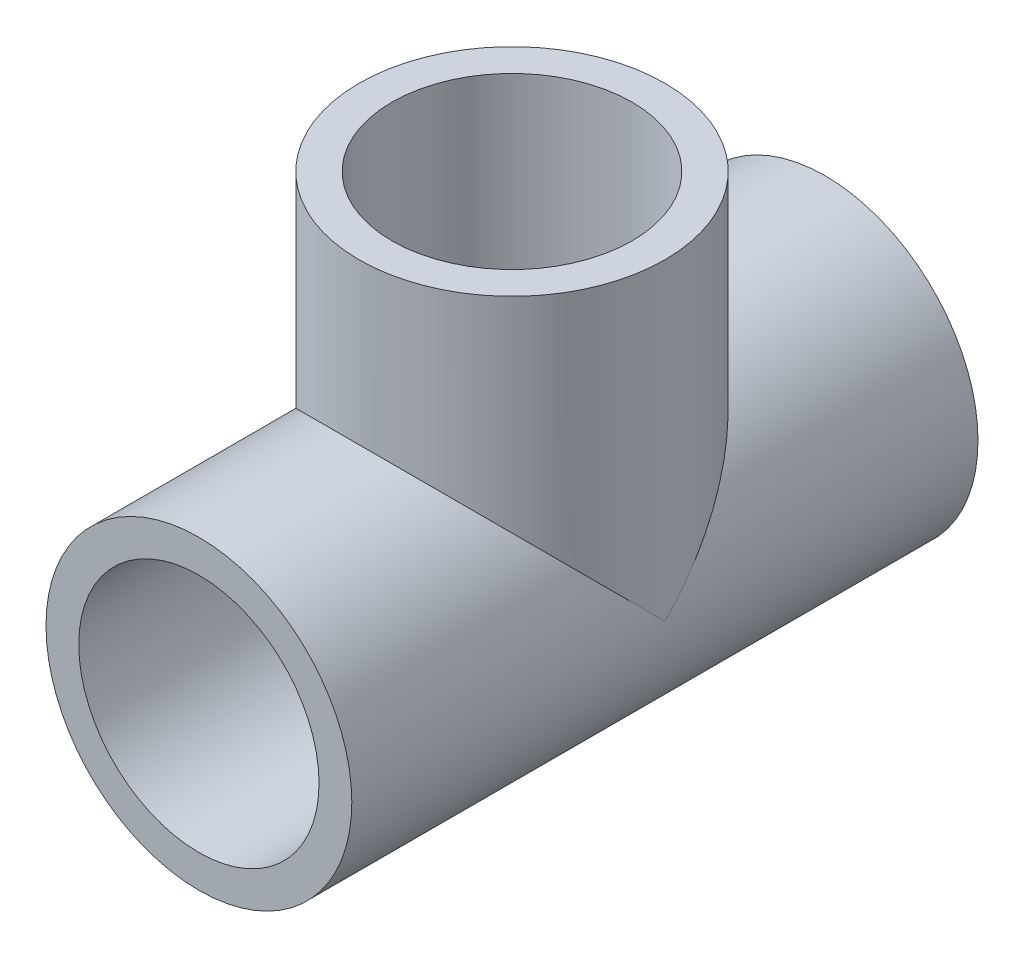
ISO-10303-21;
HEADER;
FILE_DESCRIPTION(('STEP AP214'),'2;1');
FILE_NAME('part.step','',(''),(''),'','','');
FILE_SCHEMA(('AUTOMOTIVE_DESIGN { 1 0 10303 214 1 1 1 1 }'));
ENDSEC;
DATA;
#1=APPLICATION_CONTEXT('core data for automotive mechanical design processes');
#2=APPLICATION_PROTOCOL_DEFINITION('international standard','automotive_design',2000,#1);
#3=PRODUCT_CONTEXT('',#1,'mechanical');
#4=PRODUCT('Part','Part','',(#3));
#5=PRODUCT_RELATED_PRODUCT_CATEGORY('part','',(#4));
#6=PRODUCT_DEFINITION_FORMATION('','',#4);
#7=PRODUCT_DEFINITION_CONTEXT('part definition',#1,'design');
#8=PRODUCT_DEFINITION('design','',#6,#7);
#9=PRODUCT_DEFINITION_SHAPE('','',#8);
#10=(LENGTH_UNIT() NAMED_UNIT(*) SI_UNIT(.MILLI.,.METRE.));
#11=(NAMED_UNIT(*) PLANE_ANGLE_UNIT() SI_UNIT($,.RADIAN.));
#12=(NAMED_UNIT(*) SI_UNIT($,.STERADIAN.) SOLID_ANGLE_UNIT());
#13=UNCERTAINTY_MEASURE_WITH_UNIT(LENGTH_MEASURE(1.E-05),#10,'distance_accuracy_value','');
#14=(GEOMETRIC_REPRESENTATION_CONTEXT(3) GLOBAL_UNCERTAINTY_ASSIGNED_CONTEXT((#13)) GLOBAL_UNIT_ASSIGNED_CONTEXT((#10,
#11,#12)) REPRESENTATION_CONTEXT('',''));
#15=CARTESIAN_POINT('',(0.,0.,0.));
#16=DIRECTION('',(0.,0.,1.));
#17=DIRECTION('',(1.,0.,0.));
#18=AXIS2_PLACEMENT_3D('',#15,#16,#17);
#19=CARTESIAN_POINT('',(0.,-16.66975,0.));
#20=DIRECTION('',(0.,1.,0.));
#21=DIRECTION('',(0.,0.,1.));
#22=AXIS2_PLACEMENT_3D('',#19,#20,#21);
#23=CYLINDRICAL_SURFACE('',#22,12.7);
#24=CARTESIAN_POINT('',(0.,0.,0.));
#25=DIRECTION('',(0.,0.707106781186547,0.707106781186547));
#26=DIRECTION('',(0.,0.707106781186547,-0.707106781186547));
#27=AXIS2_PLACEMENT_3D('',#24,#25,#26);
#28=ELLIPSE('',#27,17.9605122421383,12.7);
#29=CARTESIAN_POINT('',(-12.7,0.,0.));
#30=VERTEX_POINT('',#29);
#31=CARTESIAN_POINT('',(12.7,0.,0.));
#32=VERTEX_POINT('',#31);
#33=EDGE_CURVE('E50',#30,#32,#28,.F.);
#34=ORIENTED_EDGE('',*,*,#33,.T.);
#35=CARTESIAN_POINT('',(0.,0.,0.));
#36=DIRECTION('',(0.,0.707106781186547,-0.707106781186547));
#37=DIRECTION('',(0.,0.707106781186547,0.707106781186547));
#38=AXIS2_PLACEMENT_3D('',#35,#36,#37);
#39=ELLIPSE('',#38,17.9605122421383,12.7);
#40=EDGE_CURVE('E60',#32,#30,#39,.F.);
#41=ORIENTED_EDGE('',*,*,#40,.T.);
#42=EDGE_LOOP('',(#34,#41));
#43=FACE_BOUND('',#42,.T.);
#44=CARTESIAN_POINT('',(0.,15.08125,0.));
#45=DIRECTION('',(0.,1.,0.));
#46=DIRECTION('',(0.,0.,1.));
#47=AXIS2_PLACEMENT_3D('',#44,#45,#46);
#48=CIRCLE('',#47,12.7);
#49=CARTESIAN_POINT('',(0.,15.08125,12.7));
#50=VERTEX_POINT('',#49);
#51=EDGE_CURVE('E38',#50,#50,#48,.F.);
#52=ORIENTED_EDGE('',*,*,#51,.F.);
#53=EDGE_LOOP('',(#52));
#54=FACE_BOUND('',#53,.T.);
#55=ADVANCED_FACE('F34',(#43,#54),#23,.F.);
#56=CARTESIAN_POINT('',(0.,0.,-34.13125));
#57=DIRECTION('',(0.,0.,1.));
#58=DIRECTION('',(1.,0.,0.));
#59=AXIS2_PLACEMENT_3D('',#56,#57,#58);
#60=CYLINDRICAL_SURFACE('',#59,12.7);
#61=CARTESIAN_POINT('',(0.,0.,15.08125));
#62=DIRECTION('',(0.,0.,1.));
#63=DIRECTION('',(1.,0.,0.));
#64=AXIS2_PLACEMENT_3D('',#61,#62,#63);
#65=CIRCLE('',#64,12.7);
#66=CARTESIAN_POINT('',(12.7,0.,15.08125));
#67=VERTEX_POINT('',#66);
#68=EDGE_CURVE('E63',#67,#67,#65,.F.);
#69=ORIENTED_EDGE('',*,*,#68,.F.);
#70=EDGE_LOOP('',(#69));
#71=FACE_BOUND('',#70,.T.);
#72=ORIENTED_EDGE('',*,*,#40,.F.);
#73=ORIENTED_EDGE('',*,*,#33,.F.);
#74=EDGE_LOOP('',(#72,#73));
#75=FACE_BOUND('',#74,.T.);
#76=CARTESIAN_POINT('',(0.,0.,-15.08125));
#77=DIRECTION('',(0.,0.,-1.));
#78=DIRECTION('',(-1.,0.,0.));
#79=AXIS2_PLACEMENT_3D('',#76,#77,#78);
#80=CIRCLE('',#79,12.7);
#81=CARTESIAN_POINT('',(-12.7,0.,-15.08125));
#82=VERTEX_POINT('',#81);
#83=EDGE_CURVE('E84',#82,#82,#80,.F.);
#84=ORIENTED_EDGE('',*,*,#83,.F.);
#85=EDGE_LOOP('',(#84));
#86=FACE_BOUND('',#85,.T.);
#87=ADVANCED_FACE('F65',(#71,#75,#86),#60,.F.);
#88=CARTESIAN_POINT('',(0.,0.,118.243982536796));
#89=DIRECTION('',(0.,0.,-1.));
#90=DIRECTION('',(-1.,0.,0.));
#91=AXIS2_PLACEMENT_3D('',#88,#89,#90);
#92=CYLINDRICAL_SURFACE('',#91,16.66875);
#93=CARTESIAN_POINT('',(0.,0.,0.));
#94=DIRECTION('',(0.,-0.707106781186547,-0.707106781186547));
#95=DIRECTION('',(0.,0.707106781186547,-0.707106781186547));
#96=AXIS2_PLACEMENT_3D('',#93,#94,#95);
#97=ELLIPSE('',#96,23.5731723178065,16.66875);
#98=CARTESIAN_POINT('',(-16.6687499999999,0.,0.));
#99=VERTEX_POINT('',#98);
#100=CARTESIAN_POINT('',(16.66875,0.,0.));
#101=VERTEX_POINT('',#100);
#102=EDGE_CURVE('E43',#99,#101,#97,.T.);
#103=ORIENTED_EDGE('',*,*,#102,.T.);
#104=CARTESIAN_POINT('',(0.,0.,0.));
#105=DIRECTION('',(0.,0.707106781186547,-0.707106781186547));
#106=DIRECTION('',(0.,-0.707106781186547,-0.707106781186547));
#107=AXIS2_PLACEMENT_3D('',#104,#105,#106);
#108=ELLIPSE('',#107,23.5731723178065,16.66875);
#109=EDGE_CURVE('E11',#101,#99,#108,.F.);
#110=ORIENTED_EDGE('',*,*,#109,.T.);
#111=EDGE_LOOP('',(#103,#110));
#112=FACE_BOUND('',#111,.T.);
#113=CARTESIAN_POINT('',(0.,0.,-34.13125));
#114=DIRECTION('',(0.,0.,-1.));
#115=DIRECTION('',(-1.,0.,0.));
#116=AXIS2_PLACEMENT_3D('',#113,#114,#115);
#117=CIRCLE('',#116,16.66875);
#118=CARTESIAN_POINT('',(-16.6687499999999,0.,-34.13125));
#119=VERTEX_POINT('',#118);
#120=EDGE_CURVE('E78',#119,#119,#117,.T.);
#121=ORIENTED_EDGE('',*,*,#120,.F.);
#122=EDGE_LOOP('',(#121));
#123=FACE_BOUND('',#122,.T.);
#124=CARTESIAN_POINT('',(0.,0.,34.13125));
#125=DIRECTION('',(0.,0.,-1.));
#126=DIRECTION('',(-1.,0.,0.));
#127=AXIS2_PLACEMENT_3D('',#124,#125,#126);
#128=CIRCLE('',#127,16.66875);
#129=CARTESIAN_POINT('',(-16.6687499999999,0.,34.13125));
#130=VERTEX_POINT('',#129);
#131=EDGE_CURVE('E70',#130,#130,#128,.T.);
#132=ORIENTED_EDGE('',*,*,#131,.T.);
#133=EDGE_LOOP('',(#132));
#134=FACE_BOUND('',#133,.T.);
#135=ADVANCED_FACE('F36',(#112,#123,#134),#92,.T.);
#136=CARTESIAN_POINT('',(16.66875,0.,-34.13125));
#137=DIRECTION('',(0.,0.,1.));
#138=DIRECTION('',(1.,0.,0.));
#139=AXIS2_PLACEMENT_3D('',#136,#137,#138);
#140=PLANE('',#139);
#141=CARTESIAN_POINT('',(0.,0.,-34.13125));
#142=DIRECTION('',(0.,0.,-1.));
#143=DIRECTION('',(-1.,0.,0.));
#144=AXIS2_PLACEMENT_3D('',#141,#142,#143);
#145=CIRCLE('',#144,13.096875);
#146=CARTESIAN_POINT('',(-13.096875,0.,-34.13125));
#147=VERTEX_POINT('',#146);
#148=EDGE_CURVE('E91',#147,#147,#145,.T.);
#149=ORIENTED_EDGE('',*,*,#148,.F.);
#150=EDGE_LOOP('',(#149));
#151=FACE_BOUND('',#150,.T.);
#152=ORIENTED_EDGE('',*,*,#120,.T.);
#153=EDGE_LOOP('',(#152));
#154=FACE_BOUND('',#153,.T.);
#155=ADVANCED_FACE('F117',(#151,#154),#140,.F.);
#156=CARTESIAN_POINT('',(0.,0.,34.13125));
#157=DIRECTION('',(0.,0.,-1.));
#158=DIRECTION('',(-1.,0.,0.));
#159=AXIS2_PLACEMENT_3D('',#156,#157,#158);
#160=PLANE('',#159);
#161=CARTESIAN_POINT('',(0.,0.,34.13125));
#162=DIRECTION('',(0.,0.,1.));
#163=DIRECTION('',(1.,0.,0.));
#164=AXIS2_PLACEMENT_3D('',#161,#162,#163);
#165=CIRCLE('',#164,13.096875);
#166=CARTESIAN_POINT('',(13.096875,0.,34.13125));
#167=VERTEX_POINT('',#166);
#168=EDGE_CURVE('E73',#167,#167,#165,.T.);
#169=ORIENTED_EDGE('',*,*,#168,.F.);
#170=EDGE_LOOP('',(#169));
#171=FACE_BOUND('',#170,.T.);
#172=ORIENTED_EDGE('',*,*,#131,.F.);
#173=EDGE_LOOP('',(#172));
#174=FACE_BOUND('',#173,.T.);
#175=ADVANCED_FACE('F113',(#171,#174),#160,.F.);
#176=CARTESIAN_POINT('',(0.,0.,0.));
#177=DIRECTION('',(0.,1.,0.));
#178=DIRECTION('',(0.,0.,1.));
#179=AXIS2_PLACEMENT_3D('',#176,#177,#178);
#180=CYLINDRICAL_SURFACE('',#179,16.6687499999999);
#181=CARTESIAN_POINT('',(0.,34.13125,0.));
#182=DIRECTION('',(0.,1.,0.));
#183=DIRECTION('',(0.,0.,1.));
#184=AXIS2_PLACEMENT_3D('',#181,#182,#183);
#185=CIRCLE('',#184,16.66875);
#186=CARTESIAN_POINT('',(0.,34.13125,16.66875));
#187=VERTEX_POINT('',#186);
#188=EDGE_CURVE('E67',#187,#187,#185,.T.);
#189=ORIENTED_EDGE('',*,*,#188,.F.);
#190=EDGE_LOOP('',(#189));
#191=FACE_BOUND('',#190,.T.);
#192=ORIENTED_EDGE('',*,*,#109,.F.);
#193=ORIENTED_EDGE('',*,*,#102,.F.);
#194=EDGE_LOOP('',(#192,#193));
#195=FACE_BOUND('',#194,.T.);
#196=ADVANCED_FACE('F116',(#191,#195),#180,.T.);
#197=CARTESIAN_POINT('',(0.,34.13125,0.));
#198=DIRECTION('',(0.,1.,0.));
#199=DIRECTION('',(0.,0.,1.));
#200=AXIS2_PLACEMENT_3D('',#197,#198,#199);
#201=PLANE('',#200);
#202=CARTESIAN_POINT('',(0.,34.13125,0.));
#203=DIRECTION('',(0.,1.,0.));
#204=DIRECTION('',(0.,0.,1.));
#205=AXIS2_PLACEMENT_3D('',#202,#203,#204);
#206=CIRCLE('',#205,13.096875);
#207=CARTESIAN_POINT('',(0.,34.13125,13.096875));
#208=VERTEX_POINT('',#207);
#209=EDGE_CURVE('E98',#208,#208,#206,.T.);
#210=ORIENTED_EDGE('',*,*,#209,.F.);
#211=EDGE_LOOP('',(#210));
#212=FACE_BOUND('',#211,.T.);
#213=ORIENTED_EDGE('',*,*,#188,.T.);
#214=EDGE_LOOP('',(#213));
#215=FACE_BOUND('',#214,.T.);
#216=ADVANCED_FACE('F139',(#212,#215),#201,.T.);
#217=CARTESIAN_POINT('',(0.,0.,15.08125));
#218=DIRECTION('',(0.,0.,1.));
#219=DIRECTION('',(1.,0.,0.));
#220=AXIS2_PLACEMENT_3D('',#217,#218,#219);
#221=PLANE('',#220);
#222=CARTESIAN_POINT('',(0.,0.,15.08125));
#223=DIRECTION('',(0.,0.,1.));
#224=DIRECTION('',(1.,0.,0.));
#225=AXIS2_PLACEMENT_3D('',#222,#223,#224);
#226=CIRCLE('',#225,13.096875);
#227=CARTESIAN_POINT('',(13.096875,0.,15.08125));
#228=VERTEX_POINT('',#227);
#229=EDGE_CURVE('E83',#228,#228,#226,.T.);
#230=ORIENTED_EDGE('',*,*,#229,.T.);
#231=EDGE_LOOP('',(#230));
#232=FACE_BOUND('',#231,.T.);
#233=ORIENTED_EDGE('',*,*,#68,.T.);
#234=EDGE_LOOP('',(#233));
#235=FACE_BOUND('',#234,.T.);
#236=ADVANCED_FACE('F103',(#232,#235),#221,.T.);
#237=CARTESIAN_POINT('',(0.,0.,15.08125));
#238=DIRECTION('',(0.,0.,1.));
#239=DIRECTION('',(1.,0.,0.));
#240=AXIS2_PLACEMENT_3D('',#237,#238,#239);
#241=CYLINDRICAL_SURFACE('',#240,13.096875);
#242=ORIENTED_EDGE('',*,*,#229,.F.);
#243=EDGE_LOOP('',(#242));
#244=FACE_BOUND('',#243,.T.);
#245=ORIENTED_EDGE('',*,*,#168,.T.);
#246=EDGE_LOOP('',(#245));
#247=FACE_BOUND('',#246,.T.);
#248=ADVANCED_FACE('F106',(#244,#247),#241,.F.);
#249=CARTESIAN_POINT('',(0.,0.,-15.08125));
#250=DIRECTION('',(0.,0.,-1.));
#251=DIRECTION('',(-1.,0.,0.));
#252=AXIS2_PLACEMENT_3D('',#249,#250,#251);
#253=PLANE('',#252);
#254=CARTESIAN_POINT('',(0.,0.,-15.08125));
#255=DIRECTION('',(0.,0.,-1.));
#256=DIRECTION('',(-1.,0.,0.));
#257=AXIS2_PLACEMENT_3D('',#254,#255,#256);
#258=CIRCLE('',#257,13.096875);
#259=CARTESIAN_POINT('',(-13.096875,0.,-15.08125));
#260=VERTEX_POINT('',#259);
#261=EDGE_CURVE('E86',#260,#260,#258,.T.);
#262=ORIENTED_EDGE('',*,*,#261,.T.);
#263=EDGE_LOOP('',(#262));
#264=FACE_BOUND('',#263,.T.);
#265=ORIENTED_EDGE('',*,*,#83,.T.);
#266=EDGE_LOOP('',(#265));
#267=FACE_BOUND('',#266,.T.);
#268=ADVANCED_FACE('F109',(#264,#267),#253,.T.);
#269=CARTESIAN_POINT('',(0.,0.,-15.08125));
#270=DIRECTION('',(0.,0.,-1.));
#271=DIRECTION('',(-1.,0.,0.));
#272=AXIS2_PLACEMENT_3D('',#269,#270,#271);
#273=CYLINDRICAL_SURFACE('',#272,13.096875);
#274=ORIENTED_EDGE('',*,*,#261,.F.);
#275=EDGE_LOOP('',(#274));
#276=FACE_BOUND('',#275,.T.);
#277=ORIENTED_EDGE('',*,*,#148,.T.);
#278=EDGE_LOOP('',(#277));
#279=FACE_BOUND('',#278,.T.);
#280=ADVANCED_FACE('F161',(#276,#279),#273,.F.);
#281=CARTESIAN_POINT('',(0.,15.08125,0.));
#282=DIRECTION('',(0.,1.,0.));
#283=DIRECTION('',(0.,0.,1.));
#284=AXIS2_PLACEMENT_3D('',#281,#282,#283);
#285=PLANE('',#284);
#286=CARTESIAN_POINT('',(0.,15.08125,0.));
#287=DIRECTION('',(0.,1.,0.));
#288=DIRECTION('',(0.,0.,1.));
#289=AXIS2_PLACEMENT_3D('',#286,#287,#288);
#290=CIRCLE('',#289,13.096875);
#291=CARTESIAN_POINT('',(0.,15.08125,13.096875));
#292=VERTEX_POINT('',#291);
#293=EDGE_CURVE('E151',#292,#292,#290,.T.);
#294=ORIENTED_EDGE('',*,*,#293,.T.);
#295=EDGE_LOOP('',(#294));
#296=FACE_BOUND('',#295,.T.);
#297=ORIENTED_EDGE('',*,*,#51,.T.);
#298=EDGE_LOOP('',(#297));
#299=FACE_BOUND('',#298,.T.);
#300=ADVANCED_FACE('F158',(#296,#299),#285,.T.);
#301=CARTESIAN_POINT('',(0.,15.08125,0.));
#302=DIRECTION('',(0.,1.,0.));
#303=DIRECTION('',(0.,0.,1.));
#304=AXIS2_PLACEMENT_3D('',#301,#302,#303);
#305=CYLINDRICAL_SURFACE('',#304,13.096875);
#306=ORIENTED_EDGE('',*,*,#293,.F.);
#307=EDGE_LOOP('',(#306));
#308=FACE_BOUND('',#307,.T.);
#309=ORIENTED_EDGE('',*,*,#209,.T.);
#310=EDGE_LOOP('',(#309));
#311=FACE_BOUND('',#310,.T.);
#312=ADVANCED_FACE('F160',(#308,#311),#305,.F.);
#313=CLOSED_SHELL('',(#55,#87,#135,#155,#175,#196,#216,#236,#248,#268,#280,#300,#312));
#314=MANIFOLD_SOLID_BREP('B2',#313);
#315=ADVANCED_BREP_SHAPE_REPRESENTATION('',(#18,#314),#14);
#316=SHAPE_DEFINITION_REPRESENTATION(#9,#315);
ENDSEC;
END-ISO-10303-21;
